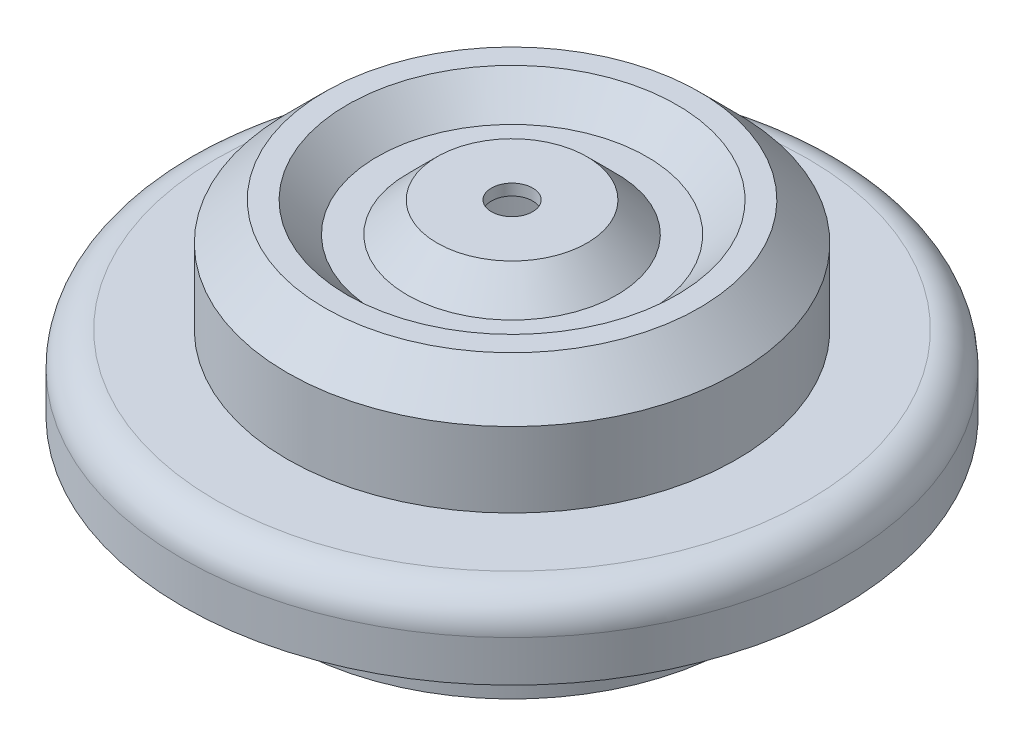
ISO-10303-21;
HEADER;
FILE_DESCRIPTION(('STEP AP214'),'2;1');
FILE_NAME('part.step','',(''),(''),'','','');
FILE_SCHEMA(('AUTOMOTIVE_DESIGN { 1 0 10303 214 1 1 1 1 }'));
ENDSEC;
DATA;
#1=APPLICATION_CONTEXT('core data for automotive mechanical design processes');
#2=APPLICATION_PROTOCOL_DEFINITION('international standard','automotive_design',2000,#1);
#3=PRODUCT_CONTEXT('',#1,'mechanical');
#4=PRODUCT('Part','Part','',(#3));
#5=PRODUCT_RELATED_PRODUCT_CATEGORY('part','',(#4));
#6=PRODUCT_DEFINITION_FORMATION('','',#4);
#7=PRODUCT_DEFINITION_CONTEXT('part definition',#1,'design');
#8=PRODUCT_DEFINITION('design','',#6,#7);
#9=PRODUCT_DEFINITION_SHAPE('','',#8);
#10=(LENGTH_UNIT() NAMED_UNIT(*) SI_UNIT(.MILLI.,.METRE.));
#11=(NAMED_UNIT(*) PLANE_ANGLE_UNIT() SI_UNIT($,.RADIAN.));
#12=(NAMED_UNIT(*) SI_UNIT($,.STERADIAN.) SOLID_ANGLE_UNIT());
#13=UNCERTAINTY_MEASURE_WITH_UNIT(LENGTH_MEASURE(1.E-05),#10,'distance_accuracy_value','');
#14=(GEOMETRIC_REPRESENTATION_CONTEXT(3) GLOBAL_UNCERTAINTY_ASSIGNED_CONTEXT((#13)) GLOBAL_UNIT_ASSIGNED_CONTEXT((#10,
#11,#12)) REPRESENTATION_CONTEXT('',''));
#15=CARTESIAN_POINT('',(0.,0.,0.));
#16=DIRECTION('',(0.,0.,1.));
#17=DIRECTION('',(1.,0.,0.));
#18=AXIS2_PLACEMENT_3D('',#15,#16,#17);
#19=CARTESIAN_POINT('',(28.5,-16.5,0.));
#20=DIRECTION('',(0.,1.,0.));
#21=DIRECTION('',(0.,0.,1.));
#22=AXIS2_PLACEMENT_3D('',#19,#20,#21);
#23=PLANE('',#22);
#24=CARTESIAN_POINT('',(0.,-16.5,0.));
#25=DIRECTION('',(0.,1.,0.));
#26=DIRECTION('',(0.,0.,1.));
#27=AXIS2_PLACEMENT_3D('',#24,#25,#26);
#28=CIRCLE('',#27,39.5);
#29=CARTESIAN_POINT('',(0.,-16.5,39.5));
#30=VERTEX_POINT('',#29);
#31=EDGE_CURVE('E96',#30,#30,#28,.T.);
#32=ORIENTED_EDGE('',*,*,#31,.F.);
#33=EDGE_LOOP('',(#32));
#34=FACE_BOUND('',#33,.T.);
#35=CARTESIAN_POINT('',(0.,-16.5,0.));
#36=DIRECTION('',(0.,1.,0.));
#37=DIRECTION('',(0.,0.,1.));
#38=AXIS2_PLACEMENT_3D('',#35,#36,#37);
#39=CIRCLE('',#38,30.);
#40=CARTESIAN_POINT('',(0.,-16.5,30.));
#41=VERTEX_POINT('',#40);
#42=EDGE_CURVE('E12',#41,#41,#39,.F.);
#43=ORIENTED_EDGE('',*,*,#42,.F.);
#44=EDGE_LOOP('',(#43));
#45=FACE_BOUND('',#44,.T.);
#46=ADVANCED_FACE('F44',(#34,#45),#23,.F.);
#47=CARTESIAN_POINT('',(0.,0.,0.));
#48=DIRECTION('',(0.,-1.,0.));
#49=DIRECTION('',(0.,0.,-1.));
#50=AXIS2_PLACEMENT_3D('',#47,#48,#49);
#51=PLANE('',#50);
#52=CARTESIAN_POINT('',(0.,0.,0.));
#53=DIRECTION('',(0.,1.,0.));
#54=DIRECTION('',(0.,0.,1.));
#55=AXIS2_PLACEMENT_3D('',#52,#53,#54);
#56=CIRCLE('',#55,2.75);
#57=CARTESIAN_POINT('',(0.,0.,2.75));
#58=VERTEX_POINT('',#57);
#59=EDGE_CURVE('E66',#58,#58,#56,.T.);
#60=ORIENTED_EDGE('',*,*,#59,.F.);
#61=EDGE_LOOP('',(#60));
#62=FACE_BOUND('',#61,.T.);
#63=CARTESIAN_POINT('',(0.,0.,0.));
#64=DIRECTION('',(0.,1.,0.));
#65=DIRECTION('',(0.,0.,1.));
#66=AXIS2_PLACEMENT_3D('',#63,#64,#65);
#67=CIRCLE('',#66,10.);
#68=CARTESIAN_POINT('',(0.,0.,10.));
#69=VERTEX_POINT('',#68);
#70=EDGE_CURVE('E51',#69,#69,#67,.T.);
#71=ORIENTED_EDGE('',*,*,#70,.T.);
#72=EDGE_LOOP('',(#71));
#73=FACE_BOUND('',#72,.T.);
#74=ADVANCED_FACE('F46',(#62,#73),#51,.F.);
#75=CARTESIAN_POINT('',(0.,-4.,0.));
#76=DIRECTION('',(0.,-1.,0.));
#77=DIRECTION('',(0.,0.,-1.));
#78=AXIS2_PLACEMENT_3D('',#75,#76,#77);
#79=CONICAL_SURFACE('',#78,14.,0.785398163397448);
#80=ORIENTED_EDGE('',*,*,#70,.F.);
#81=EDGE_LOOP('',(#80));
#82=FACE_BOUND('',#81,.T.);
#83=CARTESIAN_POINT('',(0.,-4.,0.));
#84=DIRECTION('',(0.,1.,0.));
#85=DIRECTION('',(0.,0.,1.));
#86=AXIS2_PLACEMENT_3D('',#83,#84,#85);
#87=CIRCLE('',#86,14.);
#88=CARTESIAN_POINT('',(0.,-4.,14.));
#89=VERTEX_POINT('',#88);
#90=EDGE_CURVE('E55',#89,#89,#87,.T.);
#91=ORIENTED_EDGE('',*,*,#90,.T.);
#92=EDGE_LOOP('',(#91));
#93=FACE_BOUND('',#92,.T.);
#94=ADVANCED_FACE('F197',(#82,#93),#79,.T.);
#95=CARTESIAN_POINT('',(14.,-4.,0.));
#96=DIRECTION('',(0.,-1.,0.));
#97=DIRECTION('',(0.,0.,-1.));
#98=AXIS2_PLACEMENT_3D('',#95,#96,#97);
#99=PLANE('',#98);
#100=ORIENTED_EDGE('',*,*,#90,.F.);
#101=EDGE_LOOP('',(#100));
#102=FACE_BOUND('',#101,.T.);
#103=CARTESIAN_POINT('',(0.,-4.,0.));
#104=DIRECTION('',(0.,1.,0.));
#105=DIRECTION('',(0.,0.,1.));
#106=AXIS2_PLACEMENT_3D('',#103,#104,#105);
#107=CIRCLE('',#106,18.);
#108=CARTESIAN_POINT('',(0.,-4.,18.));
#109=VERTEX_POINT('',#108);
#110=EDGE_CURVE('E60',#109,#109,#107,.T.);
#111=ORIENTED_EDGE('',*,*,#110,.T.);
#112=EDGE_LOOP('',(#111));
#113=FACE_BOUND('',#112,.T.);
#114=ADVANCED_FACE('F128',(#102,#113),#99,.F.);
#115=CARTESIAN_POINT('',(0.,0.,0.));
#116=DIRECTION('',(0.,1.,0.));
#117=DIRECTION('',(0.,0.,1.));
#118=AXIS2_PLACEMENT_3D('',#115,#116,#117);
#119=CONICAL_SURFACE('',#118,22.,0.785398163397448);
#120=ORIENTED_EDGE('',*,*,#110,.F.);
#121=EDGE_LOOP('',(#120));
#122=FACE_BOUND('',#121,.T.);
#123=CARTESIAN_POINT('',(0.,0.,0.));
#124=DIRECTION('',(0.,1.,0.));
#125=DIRECTION('',(0.,0.,1.));
#126=AXIS2_PLACEMENT_3D('',#123,#124,#125);
#127=CIRCLE('',#126,22.);
#128=CARTESIAN_POINT('',(0.,0.,22.));
#129=VERTEX_POINT('',#128);
#130=EDGE_CURVE('E123',#129,#129,#127,.T.);
#131=ORIENTED_EDGE('',*,*,#130,.T.);
#132=EDGE_LOOP('',(#131));
#133=FACE_BOUND('',#132,.T.);
#134=ADVANCED_FACE('F130',(#122,#133),#119,.F.);
#135=CARTESIAN_POINT('',(22.,0.,0.));
#136=DIRECTION('',(0.,-1.,0.));
#137=DIRECTION('',(0.,0.,-1.));
#138=AXIS2_PLACEMENT_3D('',#135,#136,#137);
#139=PLANE('',#138);
#140=ORIENTED_EDGE('',*,*,#130,.F.);
#141=EDGE_LOOP('',(#140));
#142=FACE_BOUND('',#141,.T.);
#143=CARTESIAN_POINT('',(0.,0.,0.));
#144=DIRECTION('',(0.,1.,0.));
#145=DIRECTION('',(0.,0.,1.));
#146=AXIS2_PLACEMENT_3D('',#143,#144,#145);
#147=CIRCLE('',#146,25.);
#148=CARTESIAN_POINT('',(0.,0.,25.));
#149=VERTEX_POINT('',#148);
#150=EDGE_CURVE('E120',#149,#149,#147,.T.);
#151=ORIENTED_EDGE('',*,*,#150,.T.);
#152=EDGE_LOOP('',(#151));
#153=FACE_BOUND('',#152,.T.);
#154=ADVANCED_FACE('F133',(#142,#153),#139,.F.);
#155=CARTESIAN_POINT('',(0.,-5.00000000000001,0.));
#156=DIRECTION('',(0.,-1.,0.));
#157=DIRECTION('',(0.,0.,-1.));
#158=AXIS2_PLACEMENT_3D('',#155,#156,#157);
#159=CONICAL_SURFACE('',#158,30.,0.785398163397447);
#160=ORIENTED_EDGE('',*,*,#150,.F.);
#161=EDGE_LOOP('',(#160));
#162=FACE_BOUND('',#161,.T.);
#163=CARTESIAN_POINT('',(0.,-5.00000000000001,0.));
#164=DIRECTION('',(0.,1.,0.));
#165=DIRECTION('',(0.,0.,1.));
#166=AXIS2_PLACEMENT_3D('',#163,#164,#165);
#167=CIRCLE('',#166,30.);
#168=CARTESIAN_POINT('',(0.,-5.00000000000001,30.));
#169=VERTEX_POINT('',#168);
#170=EDGE_CURVE('E117',#169,#169,#167,.T.);
#171=ORIENTED_EDGE('',*,*,#170,.T.);
#172=EDGE_LOOP('',(#171));
#173=FACE_BOUND('',#172,.T.);
#174=ADVANCED_FACE('F139',(#162,#173),#159,.T.);
#175=CARTESIAN_POINT('',(0.,0.,0.));
#176=DIRECTION('',(0.,1.,0.));
#177=DIRECTION('',(0.,0.,1.));
#178=AXIS2_PLACEMENT_3D('',#175,#176,#177);
#179=CYLINDRICAL_SURFACE('',#178,30.);
#180=ORIENTED_EDGE('',*,*,#170,.F.);
#181=EDGE_LOOP('',(#180));
#182=FACE_BOUND('',#181,.T.);
#183=CARTESIAN_POINT('',(0.,-15.,0.));
#184=DIRECTION('',(0.,1.,0.));
#185=DIRECTION('',(0.,0.,1.));
#186=AXIS2_PLACEMENT_3D('',#183,#184,#185);
#187=CIRCLE('',#186,30.);
#188=CARTESIAN_POINT('',(0.,-15.,30.));
#189=VERTEX_POINT('',#188);
#190=EDGE_CURVE('E114',#189,#189,#187,.T.);
#191=ORIENTED_EDGE('',*,*,#190,.T.);
#192=EDGE_LOOP('',(#191));
#193=FACE_BOUND('',#192,.T.);
#194=ADVANCED_FACE('F145',(#182,#193),#179,.T.);
#195=CARTESIAN_POINT('',(30.,-15.,0.));
#196=DIRECTION('',(0.,-1.,0.));
#197=DIRECTION('',(0.,0.,-1.));
#198=AXIS2_PLACEMENT_3D('',#195,#196,#197);
#199=PLANE('',#198);
#200=ORIENTED_EDGE('',*,*,#190,.F.);
#201=EDGE_LOOP('',(#200));
#202=FACE_BOUND('',#201,.T.);
#203=CARTESIAN_POINT('',(0.,-15.,0.));
#204=DIRECTION('',(0.,1.,0.));
#205=DIRECTION('',(0.,0.,1.));
#206=AXIS2_PLACEMENT_3D('',#203,#204,#205);
#207=CIRCLE('',#206,39.5);
#208=CARTESIAN_POINT('',(0.,-15.,39.5));
#209=VERTEX_POINT('',#208);
#210=EDGE_CURVE('E111',#209,#209,#207,.T.);
#211=ORIENTED_EDGE('',*,*,#210,.T.);
#212=EDGE_LOOP('',(#211));
#213=FACE_BOUND('',#212,.T.);
#214=ADVANCED_FACE('F151',(#202,#213),#199,.F.);
#215=CARTESIAN_POINT('',(0.,-19.5,0.));
#216=DIRECTION('',(0.,1.,0.));
#217=DIRECTION('',(0.,0.,1.));
#218=AXIS2_PLACEMENT_3D('',#215,#216,#217);
#219=TOROIDAL_SURFACE('',#218,39.5,4.5);
#220=ORIENTED_EDGE('',*,*,#210,.F.);
#221=EDGE_LOOP('',(#220));
#222=FACE_BOUND('',#221,.T.);
#223=CARTESIAN_POINT('',(0.,-19.5,0.));
#224=DIRECTION('',(0.,1.,0.));
#225=DIRECTION('',(0.,0.,1.));
#226=AXIS2_PLACEMENT_3D('',#223,#224,#225);
#227=CIRCLE('',#226,44.);
#228=CARTESIAN_POINT('',(0.,-19.5,44.));
#229=VERTEX_POINT('',#228);
#230=EDGE_CURVE('E108',#229,#229,#227,.T.);
#231=ORIENTED_EDGE('',*,*,#230,.T.);
#232=EDGE_LOOP('',(#231));
#233=FACE_BOUND('',#232,.T.);
#234=ADVANCED_FACE('F157',(#222,#233),#219,.T.);
#235=CARTESIAN_POINT('',(0.,0.,0.));
#236=DIRECTION('',(0.,1.,0.));
#237=DIRECTION('',(0.,0.,1.));
#238=AXIS2_PLACEMENT_3D('',#235,#236,#237);
#239=CYLINDRICAL_SURFACE('',#238,44.);
#240=ORIENTED_EDGE('',*,*,#230,.F.);
#241=EDGE_LOOP('',(#240));
#242=FACE_BOUND('',#241,.T.);
#243=CARTESIAN_POINT('',(0.,-25.,0.));
#244=DIRECTION('',(0.,1.,0.));
#245=DIRECTION('',(0.,0.,1.));
#246=AXIS2_PLACEMENT_3D('',#243,#244,#245);
#247=CIRCLE('',#246,44.);
#248=CARTESIAN_POINT('',(0.,-25.,44.));
#249=VERTEX_POINT('',#248);
#250=EDGE_CURVE('E105',#249,#249,#247,.T.);
#251=ORIENTED_EDGE('',*,*,#250,.T.);
#252=EDGE_LOOP('',(#251));
#253=FACE_BOUND('',#252,.T.);
#254=ADVANCED_FACE('F163',(#242,#253),#239,.T.);
#255=CARTESIAN_POINT('',(42.5,-25.,0.));
#256=DIRECTION('',(0.,1.,0.));
#257=DIRECTION('',(0.,0.,1.));
#258=AXIS2_PLACEMENT_3D('',#255,#256,#257);
#259=PLANE('',#258);
#260=ORIENTED_EDGE('',*,*,#250,.F.);
#261=EDGE_LOOP('',(#260));
#262=FACE_BOUND('',#261,.T.);
#263=CARTESIAN_POINT('',(0.,-25.,0.));
#264=DIRECTION('',(0.,1.,0.));
#265=DIRECTION('',(0.,0.,1.));
#266=AXIS2_PLACEMENT_3D('',#263,#264,#265);
#267=CIRCLE('',#266,42.5);
#268=CARTESIAN_POINT('',(0.,-25.,42.5));
#269=VERTEX_POINT('',#268);
#270=EDGE_CURVE('E102',#269,#269,#267,.T.);
#271=ORIENTED_EDGE('',*,*,#270,.T.);
#272=EDGE_LOOP('',(#271));
#273=FACE_BOUND('',#272,.T.);
#274=ADVANCED_FACE('F169',(#262,#273),#259,.F.);
#275=CARTESIAN_POINT('',(0.,0.,0.));
#276=DIRECTION('',(0.,1.,0.));
#277=DIRECTION('',(0.,0.,1.));
#278=AXIS2_PLACEMENT_3D('',#275,#276,#277);
#279=CYLINDRICAL_SURFACE('',#278,42.5);
#280=ORIENTED_EDGE('',*,*,#270,.F.);
#281=EDGE_LOOP('',(#280));
#282=FACE_BOUND('',#281,.T.);
#283=CARTESIAN_POINT('',(0.,-19.5,0.));
#284=DIRECTION('',(0.,1.,0.));
#285=DIRECTION('',(0.,0.,1.));
#286=AXIS2_PLACEMENT_3D('',#283,#284,#285);
#287=CIRCLE('',#286,42.5);
#288=CARTESIAN_POINT('',(0.,-19.5,42.5));
#289=VERTEX_POINT('',#288);
#290=EDGE_CURVE('E99',#289,#289,#287,.T.);
#291=ORIENTED_EDGE('',*,*,#290,.T.);
#292=EDGE_LOOP('',(#291));
#293=FACE_BOUND('',#292,.T.);
#294=ADVANCED_FACE('F175',(#282,#293),#279,.F.);
#295=CARTESIAN_POINT('',(0.,-19.5,0.));
#296=DIRECTION('',(0.,1.,0.));
#297=DIRECTION('',(0.,0.,1.));
#298=AXIS2_PLACEMENT_3D('',#295,#296,#297);
#299=TOROIDAL_SURFACE('',#298,39.5,3.);
#300=ORIENTED_EDGE('',*,*,#290,.F.);
#301=EDGE_LOOP('',(#300));
#302=FACE_BOUND('',#301,.T.);
#303=ORIENTED_EDGE('',*,*,#31,.T.);
#304=EDGE_LOOP('',(#303));
#305=FACE_BOUND('',#304,.T.);
#306=ADVANCED_FACE('F181',(#302,#305),#299,.F.);
#307=CARTESIAN_POINT('',(0.,0.,0.));
#308=DIRECTION('',(0.,1.,0.));
#309=DIRECTION('',(0.,0.,1.));
#310=AXIS2_PLACEMENT_3D('',#307,#308,#309);
#311=CYLINDRICAL_SURFACE('',#310,28.5);
#312=CARTESIAN_POINT('',(0.,-5.62132034355964,0.));
#313=DIRECTION('',(0.,1.,0.));
#314=DIRECTION('',(0.,0.,1.));
#315=AXIS2_PLACEMENT_3D('',#312,#313,#314);
#316=CIRCLE('',#315,28.5);
#317=CARTESIAN_POINT('',(0.,-5.62132034355964,28.5));
#318=VERTEX_POINT('',#317);
#319=EDGE_CURVE('E93',#318,#318,#316,.T.);
#320=ORIENTED_EDGE('',*,*,#319,.T.);
#321=EDGE_LOOP('',(#320));
#322=FACE_BOUND('',#321,.T.);
#323=CARTESIAN_POINT('',(0.,-36.5,0.));
#324=DIRECTION('',(0.,-1.,0.));
#325=DIRECTION('',(0.,0.,-1.));
#326=AXIS2_PLACEMENT_3D('',#323,#324,#325);
#327=CIRCLE('',#326,28.5);
#328=CARTESIAN_POINT('',(0.,-36.5,-28.5));
#329=VERTEX_POINT('',#328);
#330=EDGE_CURVE('E78',#329,#329,#327,.T.);
#331=ORIENTED_EDGE('',*,*,#330,.T.);
#332=EDGE_LOOP('',(#331));
#333=FACE_BOUND('',#332,.T.);
#334=ADVANCED_FACE('F187',(#322,#333),#311,.F.);
#335=CARTESIAN_POINT('',(0.,-1.5,0.));
#336=DIRECTION('',(0.,-1.,0.));
#337=DIRECTION('',(0.,0.,-1.));
#338=AXIS2_PLACEMENT_3D('',#335,#336,#337);
#339=CONICAL_SURFACE('',#338,24.3786796564404,0.785398163397449);
#340=ORIENTED_EDGE('',*,*,#319,.F.);
#341=EDGE_LOOP('',(#340));
#342=FACE_BOUND('',#341,.T.);
#343=CARTESIAN_POINT('',(0.,-1.5,0.));
#344=DIRECTION('',(0.,1.,0.));
#345=DIRECTION('',(0.,0.,1.));
#346=AXIS2_PLACEMENT_3D('',#343,#344,#345);
#347=CIRCLE('',#346,24.3786796564404);
#348=CARTESIAN_POINT('',(0.,-1.5,24.3786796564404));
#349=VERTEX_POINT('',#348);
#350=EDGE_CURVE('E90',#349,#349,#347,.T.);
#351=ORIENTED_EDGE('',*,*,#350,.T.);
#352=EDGE_LOOP('',(#351));
#353=FACE_BOUND('',#352,.T.);
#354=ADVANCED_FACE('F263',(#342,#353),#339,.F.);
#355=CARTESIAN_POINT('',(22.6213203435596,-1.5,0.));
#356=DIRECTION('',(0.,1.,0.));
#357=DIRECTION('',(0.,0.,1.));
#358=AXIS2_PLACEMENT_3D('',#355,#356,#357);
#359=PLANE('',#358);
#360=ORIENTED_EDGE('',*,*,#350,.F.);
#361=EDGE_LOOP('',(#360));
#362=FACE_BOUND('',#361,.T.);
#363=CARTESIAN_POINT('',(0.,-1.5,0.));
#364=DIRECTION('',(0.,1.,0.));
#365=DIRECTION('',(0.,0.,1.));
#366=AXIS2_PLACEMENT_3D('',#363,#364,#365);
#367=CIRCLE('',#366,22.6213203435596);
#368=CARTESIAN_POINT('',(0.,-1.5,22.6213203435596));
#369=VERTEX_POINT('',#368);
#370=EDGE_CURVE('E87',#369,#369,#367,.T.);
#371=ORIENTED_EDGE('',*,*,#370,.T.);
#372=EDGE_LOOP('',(#371));
#373=FACE_BOUND('',#372,.T.);
#374=ADVANCED_FACE('F271',(#362,#373),#359,.F.);
#375=CARTESIAN_POINT('',(0.,-5.5,0.));
#376=DIRECTION('',(0.,1.,0.));
#377=DIRECTION('',(0.,0.,1.));
#378=AXIS2_PLACEMENT_3D('',#375,#376,#377);
#379=CONICAL_SURFACE('',#378,18.6213203435596,0.785398163397449);
#380=ORIENTED_EDGE('',*,*,#370,.F.);
#381=EDGE_LOOP('',(#380));
#382=FACE_BOUND('',#381,.T.);
#383=CARTESIAN_POINT('',(0.,-5.5,0.));
#384=DIRECTION('',(0.,1.,0.));
#385=DIRECTION('',(0.,0.,1.));
#386=AXIS2_PLACEMENT_3D('',#383,#384,#385);
#387=CIRCLE('',#386,18.6213203435596);
#388=CARTESIAN_POINT('',(0.,-5.5,18.6213203435596));
#389=VERTEX_POINT('',#388);
#390=EDGE_CURVE('E84',#389,#389,#387,.T.);
#391=ORIENTED_EDGE('',*,*,#390,.T.);
#392=EDGE_LOOP('',(#391));
#393=FACE_BOUND('',#392,.T.);
#394=ADVANCED_FACE('F278',(#382,#393),#379,.T.);
#395=CARTESIAN_POINT('',(13.3786796564404,-5.5,0.));
#396=DIRECTION('',(0.,1.,0.));
#397=DIRECTION('',(0.,0.,1.));
#398=AXIS2_PLACEMENT_3D('',#395,#396,#397);
#399=PLANE('',#398);
#400=ORIENTED_EDGE('',*,*,#390,.F.);
#401=EDGE_LOOP('',(#400));
#402=FACE_BOUND('',#401,.T.);
#403=CARTESIAN_POINT('',(0.,-5.5,0.));
#404=DIRECTION('',(0.,1.,0.));
#405=DIRECTION('',(0.,0.,1.));
#406=AXIS2_PLACEMENT_3D('',#403,#404,#405);
#407=CIRCLE('',#406,13.3786796564404);
#408=CARTESIAN_POINT('',(0.,-5.5,13.3786796564404));
#409=VERTEX_POINT('',#408);
#410=EDGE_CURVE('E70',#409,#409,#407,.T.);
#411=ORIENTED_EDGE('',*,*,#410,.T.);
#412=EDGE_LOOP('',(#411));
#413=FACE_BOUND('',#412,.T.);
#414=ADVANCED_FACE('F286',(#402,#413),#399,.F.);
#415=CARTESIAN_POINT('',(0.,-1.5,0.));
#416=DIRECTION('',(0.,-1.,0.));
#417=DIRECTION('',(0.,0.,-1.));
#418=AXIS2_PLACEMENT_3D('',#415,#416,#417);
#419=CONICAL_SURFACE('',#418,9.37867965644036,0.785398163397448);
#420=ORIENTED_EDGE('',*,*,#410,.F.);
#421=EDGE_LOOP('',(#420));
#422=FACE_BOUND('',#421,.T.);
#423=CARTESIAN_POINT('',(0.,-1.5,0.));
#424=DIRECTION('',(0.,1.,0.));
#425=DIRECTION('',(0.,0.,1.));
#426=AXIS2_PLACEMENT_3D('',#423,#424,#425);
#427=CIRCLE('',#426,9.37867965644036);
#428=CARTESIAN_POINT('',(0.,-1.5,9.37867965644036));
#429=VERTEX_POINT('',#428);
#430=EDGE_CURVE('E65',#429,#429,#427,.T.);
#431=ORIENTED_EDGE('',*,*,#430,.T.);
#432=EDGE_LOOP('',(#431));
#433=FACE_BOUND('',#432,.T.);
#434=ADVANCED_FACE('F294',(#422,#433),#419,.F.);
#435=CARTESIAN_POINT('',(0.,-1.5,0.));
#436=DIRECTION('',(0.,1.,0.));
#437=DIRECTION('',(0.,0.,1.));
#438=AXIS2_PLACEMENT_3D('',#435,#436,#437);
#439=PLANE('',#438);
#440=CARTESIAN_POINT('',(0.,-1.5,0.));
#441=DIRECTION('',(0.,1.,0.));
#442=DIRECTION('',(0.,0.,1.));
#443=AXIS2_PLACEMENT_3D('',#440,#441,#442);
#444=CIRCLE('',#443,2.75);
#445=CARTESIAN_POINT('',(0.,-1.5,2.75));
#446=VERTEX_POINT('',#445);
#447=EDGE_CURVE('E63',#446,#446,#444,.T.);
#448=ORIENTED_EDGE('',*,*,#447,.T.);
#449=EDGE_LOOP('',(#448));
#450=FACE_BOUND('',#449,.T.);
#451=ORIENTED_EDGE('',*,*,#430,.F.);
#452=EDGE_LOOP('',(#451));
#453=FACE_BOUND('',#452,.T.);
#454=ADVANCED_FACE('F302',(#450,#453),#439,.F.);
#455=CARTESIAN_POINT('',(0.,-25.,0.));
#456=DIRECTION('',(0.,1.,0.));
#457=DIRECTION('',(0.,0.,1.));
#458=AXIS2_PLACEMENT_3D('',#455,#456,#457);
#459=CYLINDRICAL_SURFACE('',#458,2.75);
#460=ORIENTED_EDGE('',*,*,#59,.T.);
#461=EDGE_LOOP('',(#460));
#462=FACE_BOUND('',#461,.T.);
#463=ORIENTED_EDGE('',*,*,#447,.F.);
#464=EDGE_LOOP('',(#463));
#465=FACE_BOUND('',#464,.T.);
#466=ADVANCED_FACE('F310',(#462,#465),#459,.F.);
#467=CARTESIAN_POINT('',(0.,-36.5,0.));
#468=DIRECTION('',(0.,-1.,0.));
#469=DIRECTION('',(0.,0.,-1.));
#470=AXIS2_PLACEMENT_3D('',#467,#468,#469);
#471=PLANE('',#470);
#472=CARTESIAN_POINT('',(0.,-36.5,0.));
#473=DIRECTION('',(0.,-1.,0.));
#474=DIRECTION('',(0.,0.,-1.));
#475=AXIS2_PLACEMENT_3D('',#472,#473,#474);
#476=CIRCLE('',#475,30.);
#477=CARTESIAN_POINT('',(0.,-36.5,-30.));
#478=VERTEX_POINT('',#477);
#479=EDGE_CURVE('E73',#478,#478,#476,.T.);
#480=ORIENTED_EDGE('',*,*,#479,.T.);
#481=EDGE_LOOP('',(#480));
#482=FACE_BOUND('',#481,.T.);
#483=ORIENTED_EDGE('',*,*,#330,.F.);
#484=EDGE_LOOP('',(#483));
#485=FACE_BOUND('',#484,.T.);
#486=ADVANCED_FACE('F317',(#482,#485),#471,.T.);
#487=CARTESIAN_POINT('',(0.,-36.5,0.));
#488=DIRECTION('',(0.,1.,0.));
#489=DIRECTION('',(0.,0.,1.));
#490=AXIS2_PLACEMENT_3D('',#487,#488,#489);
#491=CYLINDRICAL_SURFACE('',#490,30.);
#492=ORIENTED_EDGE('',*,*,#479,.F.);
#493=EDGE_LOOP('',(#492));
#494=FACE_BOUND('',#493,.T.);
#495=ORIENTED_EDGE('',*,*,#42,.T.);
#496=EDGE_LOOP('',(#495));
#497=FACE_BOUND('',#496,.T.);
#498=ADVANCED_FACE('F323',(#494,#497),#491,.T.);
#499=CLOSED_SHELL('',(#46,#74,#94,#114,#134,#154,#174,#194,#214,#234,#254,#274,#294,#306,#334,
#354,#374,#394,#414,#434,#454,#466,#486,#498));
#500=MANIFOLD_SOLID_BREP('B2',#499);
#501=ADVANCED_BREP_SHAPE_REPRESENTATION('',(#18,#500),#14);
#502=SHAPE_DEFINITION_REPRESENTATION(#9,#501);
ENDSEC;
END-ISO-10303-21;
